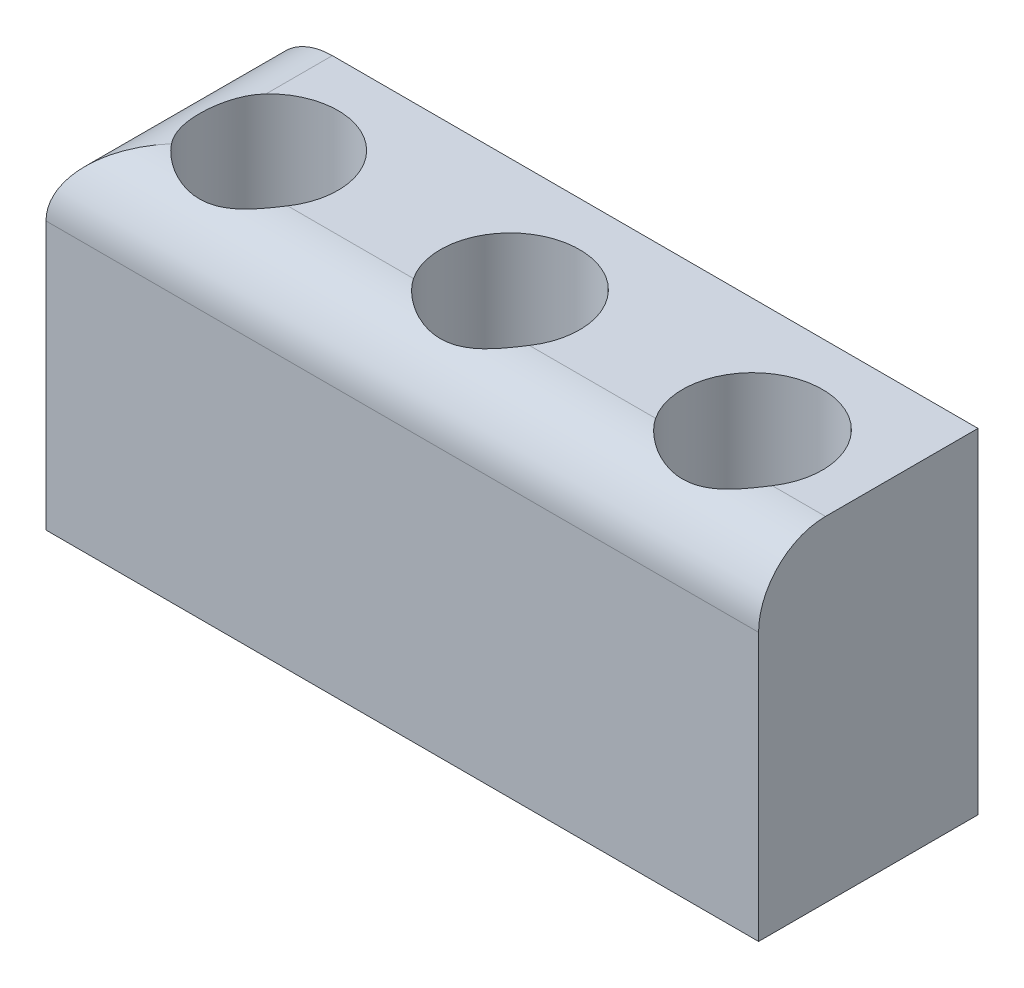
ISO-10303-21;
HEADER;
FILE_DESCRIPTION(('STEP AP214'),'2;1');
FILE_NAME('part.step','',(''),(''),'','','');
FILE_SCHEMA(('AUTOMOTIVE_DESIGN { 1 0 10303 214 1 1 1 1 }'));
ENDSEC;
DATA;
#1=APPLICATION_CONTEXT('core data for automotive mechanical design processes');
#2=APPLICATION_PROTOCOL_DEFINITION('international standard','automotive_design',2000,#1);
#3=PRODUCT_CONTEXT('',#1,'mechanical');
#4=PRODUCT('Part','Part','',(#3));
#5=PRODUCT_RELATED_PRODUCT_CATEGORY('part','',(#4));
#6=PRODUCT_DEFINITION_FORMATION('','',#4);
#7=PRODUCT_DEFINITION_CONTEXT('part definition',#1,'design');
#8=PRODUCT_DEFINITION('design','',#6,#7);
#9=PRODUCT_DEFINITION_SHAPE('','',#8);
#10=(LENGTH_UNIT() NAMED_UNIT(*) SI_UNIT(.MILLI.,.METRE.));
#11=(NAMED_UNIT(*) PLANE_ANGLE_UNIT() SI_UNIT($,.RADIAN.));
#12=(NAMED_UNIT(*) SI_UNIT($,.STERADIAN.) SOLID_ANGLE_UNIT());
#13=UNCERTAINTY_MEASURE_WITH_UNIT(LENGTH_MEASURE(1.E-05),#10,'distance_accuracy_value','');
#14=(GEOMETRIC_REPRESENTATION_CONTEXT(3) GLOBAL_UNCERTAINTY_ASSIGNED_CONTEXT((#13)) GLOBAL_UNIT_ASSIGNED_CONTEXT((#10,
#11,#12)) REPRESENTATION_CONTEXT('',''));
#15=CARTESIAN_POINT('',(0.,0.,0.));
#16=DIRECTION('',(0.,0.,1.));
#17=DIRECTION('',(1.,0.,0.));
#18=AXIS2_PLACEMENT_3D('',#15,#16,#17);
#19=CARTESIAN_POINT('',(0.,10.,0.));
#20=DIRECTION('',(0.,0.,-1.));
#21=DIRECTION('',(-1.,0.,0.));
#22=AXIS2_PLACEMENT_3D('',#19,#20,#21);
#23=PLANE('',#22);
#24=DIRECTION('',(0.,-1.,0.));
#25=VECTOR('',#24,1.);
#26=CARTESIAN_POINT('',(21.2931862765664,10.,0.));
#27=LINE('',#26,#25);
#28=CARTESIAN_POINT('',(21.2931862765664,8.,0.));
#29=VERTEX_POINT('',#28);
#30=CARTESIAN_POINT('',(21.2931862765664,0.,0.));
#31=VERTEX_POINT('',#30);
#32=EDGE_CURVE('E141',#29,#31,#27,.T.);
#33=ORIENTED_EDGE('',*,*,#32,.F.);
#34=DIRECTION('',(1.,0.,0.));
#35=VECTOR('',#34,1.);
#36=CARTESIAN_POINT('',(0.,8.,0.));
#37=LINE('',#36,#35);
#38=CARTESIAN_POINT('',(0.,8.,0.));
#39=VERTEX_POINT('',#38);
#40=EDGE_CURVE('E337',#29,#39,#37,.F.);
#41=ORIENTED_EDGE('',*,*,#40,.T.);
#42=DIRECTION('',(0.,-1.,0.));
#43=VECTOR('',#42,1.);
#44=CARTESIAN_POINT('',(0.,10.,0.));
#45=LINE('',#44,#43);
#46=CARTESIAN_POINT('',(0.,0.,0.));
#47=VERTEX_POINT('',#46);
#48=EDGE_CURVE('E122',#39,#47,#45,.T.);
#49=ORIENTED_EDGE('',*,*,#48,.T.);
#50=DIRECTION('',(1.,0.,0.));
#51=VECTOR('',#50,1.);
#52=CARTESIAN_POINT('',(0.,0.,0.));
#53=LINE('',#52,#51);
#54=EDGE_CURVE('E323',#47,#31,#53,.T.);
#55=ORIENTED_EDGE('',*,*,#54,.T.);
#56=EDGE_LOOP('',(#33,#41,#49,#55));
#57=FACE_BOUND('',#56,.T.);
#58=ADVANCED_FACE('F41',(#57),#23,.F.);
#59=CARTESIAN_POINT('',(21.2931862765664,10.,0.));
#60=DIRECTION('',(-1.,0.,0.));
#61=DIRECTION('',(0.,0.,1.));
#62=AXIS2_PLACEMENT_3D('',#59,#60,#61);
#63=PLANE('',#62);
#64=DIRECTION('',(0.,0.,-1.));
#65=VECTOR('',#64,1.);
#66=CARTESIAN_POINT('',(21.2931862765664,10.,0.));
#67=LINE('',#66,#65);
#68=CARTESIAN_POINT('',(21.2931862765664,10.,-2.));
#69=VERTEX_POINT('',#68);
#70=CARTESIAN_POINT('',(21.2931862765664,10.,-6.55624890817712));
#71=VERTEX_POINT('',#70);
#72=EDGE_CURVE('E123',#69,#71,#67,.T.);
#73=ORIENTED_EDGE('',*,*,#72,.F.);
#74=CARTESIAN_POINT('',(21.2931862765664,8.,-2.));
#75=DIRECTION('',(-1.,0.,0.));
#76=DIRECTION('',(0.,0.,1.));
#77=AXIS2_PLACEMENT_3D('',#74,#75,#76);
#78=CIRCLE('',#77,2.);
#79=EDGE_CURVE('E341',#69,#29,#78,.F.);
#80=ORIENTED_EDGE('',*,*,#79,.T.);
#81=ORIENTED_EDGE('',*,*,#32,.T.);
#82=DIRECTION('',(0.,0.,-1.));
#83=VECTOR('',#82,1.);
#84=CARTESIAN_POINT('',(21.2931862765664,0.,0.));
#85=LINE('',#84,#83);
#86=CARTESIAN_POINT('',(21.2931862765664,0.,-6.55624890817712));
#87=VERTEX_POINT('',#86);
#88=EDGE_CURVE('E138',#31,#87,#85,.T.);
#89=ORIENTED_EDGE('',*,*,#88,.T.);
#90=DIRECTION('',(0.,-1.,0.));
#91=VECTOR('',#90,1.);
#92=CARTESIAN_POINT('',(21.2931862765664,10.,-6.55624890817712));
#93=LINE('',#92,#91);
#94=EDGE_CURVE('E116',#71,#87,#93,.T.);
#95=ORIENTED_EDGE('',*,*,#94,.F.);
#96=EDGE_LOOP('',(#73,#80,#81,#89,#95));
#97=FACE_BOUND('',#96,.T.);
#98=ADVANCED_FACE('F136',(#97),#63,.F.);
#99=CARTESIAN_POINT('',(0.,10.,-6.55624890817712));
#100=DIRECTION('',(0.,0.,-1.));
#101=DIRECTION('',(-1.,0.,0.));
#102=AXIS2_PLACEMENT_3D('',#99,#100,#101);
#103=PLANE('',#102);
#104=DIRECTION('',(0.,-1.,0.));
#105=VECTOR('',#104,1.);
#106=CARTESIAN_POINT('',(0.,10.,-6.55624890817712));
#107=LINE('',#106,#105);
#108=CARTESIAN_POINT('',(0.,8.,-6.55624890817712));
#109=VERTEX_POINT('',#108);
#110=CARTESIAN_POINT('',(0.,0.,-6.55624890817712));
#111=VERTEX_POINT('',#110);
#112=EDGE_CURVE('E142',#109,#111,#107,.T.);
#113=ORIENTED_EDGE('',*,*,#112,.F.);
#114=CARTESIAN_POINT('',(2.,8.,-6.55624890817712));
#115=DIRECTION('',(0.,0.,-1.));
#116=DIRECTION('',(-1.,0.,0.));
#117=AXIS2_PLACEMENT_3D('',#114,#115,#116);
#118=CIRCLE('',#117,2.);
#119=CARTESIAN_POINT('',(2.,10.,-6.55624890817712));
#120=VERTEX_POINT('',#119);
#121=EDGE_CURVE('E11',#109,#120,#118,.T.);
#122=ORIENTED_EDGE('',*,*,#121,.T.);
#123=DIRECTION('',(1.,0.,0.));
#124=VECTOR('',#123,1.);
#125=CARTESIAN_POINT('',(0.,10.,-6.55624890817712));
#126=LINE('',#125,#124);
#127=EDGE_CURVE('E111',#120,#71,#126,.T.);
#128=ORIENTED_EDGE('',*,*,#127,.T.);
#129=ORIENTED_EDGE('',*,*,#94,.T.);
#130=DIRECTION('',(1.,0.,0.));
#131=VECTOR('',#130,1.);
#132=CARTESIAN_POINT('',(0.,0.,-6.55624890817712));
#133=LINE('',#132,#131);
#134=EDGE_CURVE('E329',#111,#87,#133,.T.);
#135=ORIENTED_EDGE('',*,*,#134,.F.);
#136=EDGE_LOOP('',(#113,#122,#128,#129,#135));
#137=FACE_BOUND('',#136,.T.);
#138=ADVANCED_FACE('F113',(#137),#103,.T.);
#139=CARTESIAN_POINT('',(10.7125456911819,10.,-3.15215181068118));
#140=DIRECTION('',(0.,-1.,0.));
#141=DIRECTION('',(0.,0.,-1.));
#142=AXIS2_PLACEMENT_3D('',#139,#140,#141);
#143=CYLINDRICAL_SURFACE('',#142,2.08);
#144=CARTESIAN_POINT('',(10.7125456911819,10.,-3.15215181068118));
#145=DIRECTION('',(0.,1.,0.));
#146=DIRECTION('',(0.,0.,1.));
#147=AXIS2_PLACEMENT_3D('',#144,#145,#146);
#148=CIRCLE('',#147,2.08);
#149=CARTESIAN_POINT('',(12.4442922676601,10.,-2.));
#150=VERTEX_POINT('',#149);
#151=CARTESIAN_POINT('',(8.98079911470363,10.,-2.));
#152=VERTEX_POINT('',#151);
#153=EDGE_CURVE('E134',#150,#152,#148,.T.);
#154=ORIENTED_EDGE('',*,*,#153,.T.);
#155=CARTESIAN_POINT('',(8.98079911470363,10.,-2.));
#156=CARTESIAN_POINT('',(9.01180896715374,10.0000019166528,-1.95338103054374));
#157=CARTESIAN_POINT('',(9.04467929727003,9.99837017862141,-1.90806709129068));
#158=CARTESIAN_POINT('',(9.11382249488943,9.99240214108706,-1.82038861836455));
#159=CARTESIAN_POINT('',(9.15009110295871,9.98806918977738,-1.77802050545357));
#160=CARTESIAN_POINT('',(9.26324458610879,9.97190997339697,-1.65610048268165));
#161=CARTESIAN_POINT('',(9.34480683664065,9.95691156190674,-1.58124043804073));
#162=CARTESIAN_POINT('',(9.51775955711176,9.92300619119465,-1.4460118153078));
#163=CARTESIAN_POINT('',(9.60910960513722,9.90411503081034,-1.38558672892647));
#164=CARTESIAN_POINT('',(9.8003283720189,9.86661850179612,-1.27965913078393));
#165=CARTESIAN_POINT('',(9.90021021524761,9.84801362738575,-1.23418015093139));
#166=CARTESIAN_POINT('',(10.115140293136,9.81386343226349,-1.15626295850057));
#167=CARTESIAN_POINT('',(10.2307608459067,9.79869266070333,-1.12519507994771));
#168=CARTESIAN_POINT('',(10.4073198790383,9.7829523507128,-1.09379768310674));
#169=CARTESIAN_POINT('',(10.4666796466666,9.77887502597061,-1.08586603507893));
#170=CARTESIAN_POINT('',(10.5859788825626,9.77332296594361,-1.07514254852599));
#171=CARTESIAN_POINT('',(10.6459182749269,9.77184789440609,-1.07235004593911));
#172=CARTESIAN_POINT('',(10.8143484948677,9.77158835963892,-1.07182320845275));
#173=CARTESIAN_POINT('',(10.9229314559172,9.77594147039952,-1.08000001855579));
#174=CARTESIAN_POINT('',(11.1368639585769,9.79264091612337,-1.11300808452386));
#175=CARTESIAN_POINT('',(11.2422112780962,9.80499262103718,-1.13785052946263));
#176=CARTESIAN_POINT('',(11.4455772305949,9.83455223787364,-1.20271769407757));
#177=CARTESIAN_POINT('',(11.5436816916135,9.85168502670209,-1.24251061124707));
#178=CARTESIAN_POINT('',(11.7326093243011,9.88736086484379,-1.33638565981454));
#179=CARTESIAN_POINT('',(11.8234262368483,9.90590510034153,-1.39047990666235));
#180=CARTESIAN_POINT('',(11.9969207029794,9.9407502466485,-1.51259571857778));
#181=CARTESIAN_POINT('',(12.0795173167456,9.95702937860135,-1.58073868425591));
#182=CARTESIAN_POINT('',(12.2336275033505,9.98304107428705,-1.72944607301804));
#183=CARTESIAN_POINT('',(12.3051764891037,9.99279490456057,-1.80996908268802));
#184=CARTESIAN_POINT('',(12.3829965385072,9.99816311696467,-1.91261406853426));
#185=CARTESIAN_POINT('',(12.3956304918317,9.99884456169817,-1.92982469870153));
#186=CARTESIAN_POINT('',(12.4203632483832,9.99976266836173,-1.96462805566558));
#187=CARTESIAN_POINT('',(12.4324622506076,9.99999949706791,-1.98222063668618));
#188=CARTESIAN_POINT('',(12.4442922676601,10.,-2.));
#189=B_SPLINE_CURVE_WITH_KNOTS('',3,(#155,#156,#157,#158,#159,#160,#161,#162,#163,#164,#165,
#166,#167,#168,#169,#170,#171,#172,#173,#174,#175,#176,#177,#178,#179,#180,#181,#182,#183,#184,
#185,#186,#187,#188),.UNSPECIFIED.,.F.,.F.,(4,2,2,2,2,2,2,2,2,2,2,2,2,2,2,2,4),(0.,
0.167808567179974,0.33540954562784,0.668859517194502,1.00098192435599,1.33362476427687,
1.6934662317237,1.87330072827306,2.05311198562873,2.37822992216897,2.70356635708084,
3.02405382143709,3.34481366336347,3.66847115111884,3.99106860362878,4.0551424901214,
4.11919233760168),.UNSPECIFIED.);
#190=EDGE_CURVE('E162',#152,#150,#189,.T.);
#191=ORIENTED_EDGE('',*,*,#190,.T.);
#192=EDGE_LOOP('',(#154,#191));
#193=FACE_BOUND('',#192,.T.);
#194=CARTESIAN_POINT('',(10.7125456911819,0.,-3.15215181068118));
#195=DIRECTION('',(0.,1.,0.));
#196=DIRECTION('',(0.,0.,1.));
#197=AXIS2_PLACEMENT_3D('',#194,#195,#196);
#198=CIRCLE('',#197,2.08);
#199=CARTESIAN_POINT('',(10.7125456911819,0.,-1.07215181068118));
#200=VERTEX_POINT('',#199);
#201=EDGE_CURVE('E319',#200,#200,#198,.T.);
#202=ORIENTED_EDGE('',*,*,#201,.F.);
#203=EDGE_LOOP('',(#202));
#204=FACE_BOUND('',#203,.T.);
#205=ADVANCED_FACE('F177',(#193,#204),#143,.F.);
#206=CARTESIAN_POINT('',(3.50247739127908,10.,-3.15215181068118));
#207=DIRECTION('',(0.,-1.,0.));
#208=DIRECTION('',(0.,0.,-1.));
#209=AXIS2_PLACEMENT_3D('',#206,#207,#208);
#210=CYLINDRICAL_SURFACE('',#209,2.07);
#211=CARTESIAN_POINT('',(2.,10.,-4.57604144428879));
#212=CARTESIAN_POINT('',(1.96036679714811,9.99999707882455,-4.53422316293406));
#213=CARTESIAN_POINT('',(1.92251587021773,9.99882261789642,-4.49078245878152));
#214=CARTESIAN_POINT('',(1.85061662715664,9.99473859199886,-4.40097642169513));
#215=CARTESIAN_POINT('',(1.81656601006317,9.99183008377862,-4.35461288534611));
#216=CARTESIAN_POINT('',(1.72045112077785,9.98141696742201,-4.21161130740531));
#217=CARTESIAN_POINT('',(1.66436244935136,9.97222290315426,-4.11099733985641));
#218=CARTESIAN_POINT('',(1.56967921530682,9.95375567599168,-3.90205267409746));
#219=CARTESIAN_POINT('',(1.53106668848009,9.94448260434939,-3.79373003304136));
#220=CARTESIAN_POINT('',(1.47227150718663,9.9293611235774,-3.57201823316238));
#221=CARTESIAN_POINT('',(1.4520722660175,9.92350963399121,-3.45863373085755));
#222=CARTESIAN_POINT('',(1.4307128104904,9.91730159347554,-3.22948897901125));
#223=CARTESIAN_POINT('',(1.42962449841147,9.91696579489131,-3.11372139726664));
#224=CARTESIAN_POINT('',(1.44672345146167,9.92196713741477,-2.88365286995667));
#225=CARTESIAN_POINT('',(1.46492711904998,9.92730910589429,-2.76935325617845));
#226=CARTESIAN_POINT('',(1.51926160419367,9.94155748481635,-2.54851847207674));
#227=CARTESIAN_POINT('',(1.55492110976482,9.95036905366634,-2.44185939413661));
#228=CARTESIAN_POINT('',(1.64296108715625,9.96838165030904,-2.2358531776544));
#229=CARTESIAN_POINT('',(1.69531160720114,9.97758195506095,-2.13649333074763));
#230=CARTESIAN_POINT('',(1.77372614595959,9.98724459864288,-2.01307291818252));
#231=CARTESIAN_POINT('',(1.79283975780935,9.98934168283344,-1.98458204824374));
#232=CARTESIAN_POINT('',(1.83244913092659,9.99306859050462,-1.92860082018352));
#233=CARTESIAN_POINT('',(1.85294311237602,9.99469900197677,-1.90110924147882));
#234=CARTESIAN_POINT('',(1.87412225414689,9.99603476750755,-1.87412225414689));
#235=B_SPLINE_CURVE_WITH_KNOTS('',3,(#211,#212,#213,#214,#215,#216,#217,#218,#219,#220,#221,
#222,#223,#224,#225,#226,#227,#228,#229,#230,#231,#232,#233,#234),.UNSPECIFIED.,.F.,.F.,(4,2,2,
2,2,2,2,2,2,2,2,4),(0.,0.17270140314731,0.345297667415201,0.690225662025595,1.03479828590721,
1.379060210889,1.72461709832327,2.0704680215931,2.40745696425314,2.74384455703446,
2.84692906580633,2.9498831140911),.UNSPECIFIED.);
#236=CARTESIAN_POINT('',(2.,10.,-4.57604144428879));
#237=VERTEX_POINT('',#236);
#238=CARTESIAN_POINT('',(1.87412225414689,9.99603476750755,-1.87412225414689));
#239=VERTEX_POINT('',#238);
#240=EDGE_CURVE('E66',#237,#239,#235,.T.);
#241=ORIENTED_EDGE('',*,*,#240,.T.);
#242=CARTESIAN_POINT('',(1.87412225414689,9.99603476750755,-1.87412225414689));
#243=CARTESIAN_POINT('',(1.94507286388203,9.990319517779,-1.78365756447952));
#244=CARTESIAN_POINT('',(2.02318854937418,9.9788690208992,-1.69969420692727));
#245=CARTESIAN_POINT('',(2.19138674646631,9.94941867234756,-1.54627939916142));
#246=CARTESIAN_POINT('',(2.28145387450414,9.93142718910737,-1.47680958408447));
#247=CARTESIAN_POINT('',(2.471120016652,9.89382878924803,-1.3538244796847));
#248=CARTESIAN_POINT('',(2.5706918322233,9.87422650323236,-1.30026536774207));
#249=CARTESIAN_POINT('',(2.77778845376593,9.83795768172353,-1.20987270045166));
#250=CARTESIAN_POINT('',(2.88531301351563,9.82129105539462,-1.17303862753873));
#251=CARTESIAN_POINT('',(3.05227015663797,9.80133874380286,-1.13085014442994));
#252=CARTESIAN_POINT('',(3.10979401599607,9.79548079123884,-1.11888795397806));
#253=CARTESIAN_POINT('',(3.22582262587424,9.78602992905087,-1.09988186401231));
#254=CARTESIAN_POINT('',(3.28432690234669,9.78243595544834,-1.09283565401869));
#255=CARTESIAN_POINT('',(3.40178436230516,9.77779040247215,-1.08376414879636));
#256=CARTESIAN_POINT('',(3.46073719522642,9.77673700861331,-1.08173527015714));
#257=CARTESIAN_POINT('',(3.57857215981747,9.77723852888688,-1.08271089441086));
#258=CARTESIAN_POINT('',(3.63745429684939,9.77879323081001,-1.08571498779298));
#259=CARTESIAN_POINT('',(3.80062544083609,9.78662867022699,-1.10105171060453));
#260=CARTESIAN_POINT('',(3.90432285187838,9.79565893095703,-1.11885126321481));
#261=CARTESIAN_POINT('',(4.10720065971113,9.81970801836295,-1.16968101434919));
#262=CARTESIAN_POINT('',(4.20637549918926,9.83473400275226,-1.20272942440583));
#263=CARTESIAN_POINT('',(4.4029085038148,9.86840441335405,-1.28506359483207));
#264=CARTESIAN_POINT('',(4.49994385561551,9.88718925702669,-1.33506074507491));
#265=CARTESIAN_POINT('',(4.68498068935694,9.92373475876342,-1.44967871941794));
#266=CARTESIAN_POINT('',(4.77299533918798,9.94149689261751,-1.51427777355629));
#267=CARTESIAN_POINT('',(4.92513523114569,9.9693240153861,-1.64571155583157));
#268=CARTESIAN_POINT('',(4.99083234498389,9.9801645208527,-1.71054970157138));
#269=CARTESIAN_POINT('',(5.08275905434569,9.99166910590021,-1.81433324320037));
#270=CARTESIAN_POINT('',(5.11234315100588,9.99471238461133,-1.85008242059616));
#271=CARTESIAN_POINT('',(5.16911707885598,9.99887926197681,-1.92358648607553));
#272=CARTESIAN_POINT('',(5.19630482857778,10.0000012070466,-1.96134307304321));
#273=CARTESIAN_POINT('',(5.22220010298119,10.,-2.));
#274=B_SPLINE_CURVE_WITH_KNOTS('',3,(#242,#243,#244,#245,#246,#247,#248,#249,#250,#251,#252,
#253,#254,#255,#256,#257,#258,#259,#260,#261,#262,#263,#264,#265,#266,#267,#268,#269,#270,#271,
#272,#273),.UNSPECIFIED.,.F.,.F.,(4,2,2,2,2,2,2,2,2,2,2,2,2,2,2,4),(0.,0.344241691174559,
0.688044506108547,1.03089141828971,1.37372772016919,1.55064982293769,1.72748871731794,
1.90420127569294,2.08089945644212,2.39612269559112,2.71172338050438,3.04266985950114,
3.37312614763692,3.65092420787513,3.79030211783007,3.92979992239504),.UNSPECIFIED.);
#275=CARTESIAN_POINT('',(5.22220010298119,10.,-2.));
#276=VERTEX_POINT('',#275);
#277=EDGE_CURVE('E190',#239,#276,#274,.T.);
#278=ORIENTED_EDGE('',*,*,#277,.T.);
#279=CARTESIAN_POINT('',(3.50247739127908,10.,-3.15215181068118));
#280=DIRECTION('',(0.,1.,0.));
#281=DIRECTION('',(0.,0.,1.));
#282=AXIS2_PLACEMENT_3D('',#279,#280,#281);
#283=CIRCLE('',#282,2.07);
#284=EDGE_CURVE('E297',#276,#237,#283,.T.);
#285=ORIENTED_EDGE('',*,*,#284,.T.);
#286=EDGE_LOOP('',(#241,#278,#285));
#287=FACE_BOUND('',#286,.T.);
#288=CARTESIAN_POINT('',(3.50247739127908,0.,-3.15215181068118));
#289=DIRECTION('',(0.,1.,0.));
#290=DIRECTION('',(0.,0.,1.));
#291=AXIS2_PLACEMENT_3D('',#288,#289,#290);
#292=CIRCLE('',#291,2.07);
#293=CARTESIAN_POINT('',(3.50247739127908,0.,-1.08215181068118));
#294=VERTEX_POINT('',#293);
#295=EDGE_CURVE('E315',#294,#294,#292,.T.);
#296=ORIENTED_EDGE('',*,*,#295,.F.);
#297=EDGE_LOOP('',(#296));
#298=FACE_BOUND('',#297,.T.);
#299=ADVANCED_FACE('F203',(#287,#298),#210,.F.);
#300=CARTESIAN_POINT('',(17.959518774191,10.,-3.15215181068118));
#301=DIRECTION('',(0.,-1.,0.));
#302=DIRECTION('',(0.,0.,-1.));
#303=AXIS2_PLACEMENT_3D('',#300,#301,#302);
#304=CYLINDRICAL_SURFACE('',#303,2.09);
#305=CARTESIAN_POINT('',(17.959518774191,10.,-3.15215181068118));
#306=DIRECTION('',(0.,1.,0.));
#307=DIRECTION('',(0.,0.,1.));
#308=AXIS2_PLACEMENT_3D('',#305,#306,#307);
#309=CIRCLE('',#308,2.09);
#310=CARTESIAN_POINT('',(19.7032636537947,10.,-2.));
#311=VERTEX_POINT('',#310);
#312=CARTESIAN_POINT('',(16.2157738945874,10.,-2.));
#313=VERTEX_POINT('',#312);
#314=EDGE_CURVE('E301',#311,#313,#309,.T.);
#315=ORIENTED_EDGE('',*,*,#314,.T.);
#316=CARTESIAN_POINT('',(16.2157738945874,10.,-2.));
#317=CARTESIAN_POINT('',(16.2467295704129,10.0000019741106,-1.95313985606773));
#318=CARTESIAN_POINT('',(16.279552289612,9.99835327209272,-1.90758088545158));
#319=CARTESIAN_POINT('',(16.3486120516914,9.99231893908771,-1.81940755327972));
#320=CARTESIAN_POINT('',(16.3848447690364,9.98793673681227,-1.77678957701161));
#321=CARTESIAN_POINT('',(16.4978965614307,9.97158596307411,-1.65412891720234));
#322=CARTESIAN_POINT('',(16.5794077707726,9.95640106789979,-1.57877048546052));
#323=CARTESIAN_POINT('',(16.7522911733626,9.92202082117489,-1.4425346689784));
#324=CARTESIAN_POINT('',(16.84362208311,9.90284196478621,-1.38159985950296));
#325=CARTESIAN_POINT('',(17.0348581636715,9.86468387305603,-1.27461851795193));
#326=CARTESIAN_POINT('',(17.1347772193522,9.84570501885834,-1.22859669186551));
#327=CARTESIAN_POINT('',(17.3501791029127,9.81067595292403,-1.14939942923633));
#328=CARTESIAN_POINT('',(17.4662632709869,9.795010325933,-1.11764349887471));
#329=CARTESIAN_POINT('',(17.6436279171608,9.77860309517865,-1.08528570219803));
#330=CARTESIAN_POINT('',(17.7032728016109,9.77431608599766,-1.07704594967914));
#331=CARTESIAN_POINT('',(17.8231772465777,9.76838564706258,-1.06573450646378));
#332=CARTESIAN_POINT('',(17.8834367235968,9.76674186289441,-1.06266212290346));
#333=CARTESIAN_POINT('',(18.0526954232347,9.76608702553137,-1.06139696148632));
#334=CARTESIAN_POINT('',(18.1618211739339,9.77026701318079,-1.06913530719302));
#335=CARTESIAN_POINT('',(18.3768936859951,9.78682446060064,-1.1013565044714));
#336=CARTESIAN_POINT('',(18.4828382311408,9.79920750267432,-1.12585075906473));
#337=CARTESIAN_POINT('',(18.6870624337084,9.82896654119358,-1.19000140325922));
#338=CARTESIAN_POINT('',(18.7854466531901,9.84624734347235,-1.22937307787282));
#339=CARTESIAN_POINT('',(18.9749993400326,9.88237020236857,-1.32238274915134));
#340=CARTESIAN_POINT('',(19.0661616181094,9.90121357041538,-1.37603281453285));
#341=CARTESIAN_POINT('',(19.2408298075001,9.93689906685412,-1.49751600015685));
#342=CARTESIAN_POINT('',(19.3242159293335,9.95371079040045,-1.56553058001014));
#343=CARTESIAN_POINT('',(19.4799313677929,9.98089123546876,-1.71411733264109));
#344=CARTESIAN_POINT('',(19.55229523521,9.99128041622523,-1.79464859639096));
#345=CARTESIAN_POINT('',(19.6329402060382,9.99758416945758,-1.89980808699465));
#346=CARTESIAN_POINT('',(19.6474939112682,9.99847898283674,-1.91949534626032));
#347=CARTESIAN_POINT('',(19.6759038748367,9.99968651760369,-1.95937401016248));
#348=CARTESIAN_POINT('',(19.6897603670009,9.99999943542601,-1.97956524233586));
#349=CARTESIAN_POINT('',(19.7032636537947,10.,-2.));
#350=B_SPLINE_CURVE_WITH_KNOTS('',3,(#316,#317,#318,#319,#320,#321,#322,#323,#324,#325,#326,
#327,#328,#329,#330,#331,#332,#333,#334,#335,#336,#337,#338,#339,#340,#341,#342,#343,#344,#345,
#346,#347,#348,#349),.UNSPECIFIED.,.F.,.F.,(4,2,2,2,2,2,2,2,2,2,2,2,2,2,2,2,4),(0.,
0.168320843463202,0.336430980406311,0.670844173028901,1.00390268937026,1.3375101880106,
1.69939447715465,1.88023984255198,2.06106095746308,2.38766490635012,2.71449134282624,
3.03535629278303,3.35649331786445,3.68195979464509,4.00638407077827,4.07986649842747,
4.15332411559694),.UNSPECIFIED.);
#351=EDGE_CURVE('E170',#313,#311,#350,.T.);
#352=ORIENTED_EDGE('',*,*,#351,.T.);
#353=EDGE_LOOP('',(#315,#352));
#354=FACE_BOUND('',#353,.T.);
#355=CARTESIAN_POINT('',(17.959518774191,0.,-3.15215181068118));
#356=DIRECTION('',(0.,1.,0.));
#357=DIRECTION('',(0.,0.,1.));
#358=AXIS2_PLACEMENT_3D('',#355,#356,#357);
#359=CIRCLE('',#358,2.09);
#360=CARTESIAN_POINT('',(17.959518774191,0.,-1.06215181068118));
#361=VERTEX_POINT('',#360);
#362=EDGE_CURVE('E311',#361,#361,#359,.T.);
#363=ORIENTED_EDGE('',*,*,#362,.F.);
#364=EDGE_LOOP('',(#363));
#365=FACE_BOUND('',#364,.T.);
#366=ADVANCED_FACE('F185',(#354,#365),#304,.F.);
#367=CARTESIAN_POINT('',(0.,10.,0.));
#368=DIRECTION('',(-1.,0.,0.));
#369=DIRECTION('',(0.,0.,1.));
#370=AXIS2_PLACEMENT_3D('',#367,#368,#369);
#371=PLANE('',#370);
#372=ORIENTED_EDGE('',*,*,#48,.F.);
#373=DIRECTION('',(0.,0.,-1.));
#374=VECTOR('',#373,1.);
#375=CARTESIAN_POINT('',(0.,8.,0.));
#376=LINE('',#375,#374);
#377=EDGE_CURVE('E52',#39,#109,#376,.T.);
#378=ORIENTED_EDGE('',*,*,#377,.T.);
#379=ORIENTED_EDGE('',*,*,#112,.T.);
#380=DIRECTION('',(0.,0.,-1.));
#381=VECTOR('',#380,1.);
#382=CARTESIAN_POINT('',(0.,0.,0.));
#383=LINE('',#382,#381);
#384=EDGE_CURVE('E308',#47,#111,#383,.T.);
#385=ORIENTED_EDGE('',*,*,#384,.F.);
#386=EDGE_LOOP('',(#372,#378,#379,#385));
#387=FACE_BOUND('',#386,.T.);
#388=ADVANCED_FACE('F211',(#387),#371,.T.);
#389=CARTESIAN_POINT('',(0.,10.,0.));
#390=DIRECTION('',(0.,1.,0.));
#391=DIRECTION('',(0.,0.,1.));
#392=AXIS2_PLACEMENT_3D('',#389,#390,#391);
#393=PLANE('',#392);
#394=ORIENTED_EDGE('',*,*,#284,.F.);
#395=DIRECTION('',(1.,0.,0.));
#396=VECTOR('',#395,1.);
#397=CARTESIAN_POINT('',(21.2931862765664,10.,-2.));
#398=LINE('',#397,#396);
#399=EDGE_CURVE('E158',#276,#152,#398,.T.);
#400=ORIENTED_EDGE('',*,*,#399,.T.);
#401=ORIENTED_EDGE('',*,*,#153,.F.);
#402=DIRECTION('',(1.,0.,0.));
#403=VECTOR('',#402,1.);
#404=CARTESIAN_POINT('',(21.2931862765664,10.,-2.));
#405=LINE('',#404,#403);
#406=EDGE_CURVE('E155',#150,#313,#405,.T.);
#407=ORIENTED_EDGE('',*,*,#406,.T.);
#408=ORIENTED_EDGE('',*,*,#314,.F.);
#409=DIRECTION('',(1.,0.,0.));
#410=VECTOR('',#409,1.);
#411=CARTESIAN_POINT('',(21.2931862765664,10.,-2.));
#412=LINE('',#411,#410);
#413=EDGE_CURVE('E130',#311,#69,#412,.T.);
#414=ORIENTED_EDGE('',*,*,#413,.T.);
#415=ORIENTED_EDGE('',*,*,#72,.T.);
#416=ORIENTED_EDGE('',*,*,#127,.F.);
#417=DIRECTION('',(0.,0.,-1.));
#418=VECTOR('',#417,1.);
#419=CARTESIAN_POINT('',(2.,10.,0.));
#420=LINE('',#419,#418);
#421=EDGE_CURVE('E146',#120,#237,#420,.F.);
#422=ORIENTED_EDGE('',*,*,#421,.T.);
#423=EDGE_LOOP('',(#394,#400,#401,#407,#408,#414,#415,#416,#422));
#424=FACE_BOUND('',#423,.T.);
#425=ADVANCED_FACE('F127',(#424),#393,.T.);
#426=CARTESIAN_POINT('',(0.,0.,0.));
#427=DIRECTION('',(0.,1.,0.));
#428=DIRECTION('',(0.,0.,1.));
#429=AXIS2_PLACEMENT_3D('',#426,#427,#428);
#430=PLANE('',#429);
#431=ORIENTED_EDGE('',*,*,#362,.T.);
#432=EDGE_LOOP('',(#431));
#433=FACE_BOUND('',#432,.T.);
#434=ORIENTED_EDGE('',*,*,#295,.T.);
#435=EDGE_LOOP('',(#434));
#436=FACE_BOUND('',#435,.T.);
#437=ORIENTED_EDGE('',*,*,#201,.T.);
#438=EDGE_LOOP('',(#437));
#439=FACE_BOUND('',#438,.T.);
#440=ORIENTED_EDGE('',*,*,#54,.F.);
#441=ORIENTED_EDGE('',*,*,#384,.T.);
#442=ORIENTED_EDGE('',*,*,#134,.T.);
#443=ORIENTED_EDGE('',*,*,#88,.F.);
#444=EDGE_LOOP('',(#440,#441,#442,#443));
#445=FACE_BOUND('',#444,.T.);
#446=ADVANCED_FACE('F227',(#433,#436,#439,#445),#430,.F.);
#447=CARTESIAN_POINT('',(2.,8.,0.));
#448=DIRECTION('',(0.,0.,-1.));
#449=DIRECTION('',(-1.,0.,0.));
#450=AXIS2_PLACEMENT_3D('',#447,#448,#449);
#451=CYLINDRICAL_SURFACE('',#450,2.);
#452=ORIENTED_EDGE('',*,*,#121,.F.);
#453=ORIENTED_EDGE('',*,*,#377,.F.);
#454=CARTESIAN_POINT('',(2.,8.,-2.));
#455=DIRECTION('',(-0.707106781186547,0.,-0.707106781186547));
#456=DIRECTION('',(0.707106781186547,0.,-0.707106781186547));
#457=AXIS2_PLACEMENT_3D('',#454,#455,#456);
#458=ELLIPSE('',#457,2.82842712474619,2.);
#459=EDGE_CURVE('E46',#239,#39,#458,.F.);
#460=ORIENTED_EDGE('',*,*,#459,.F.);
#461=ORIENTED_EDGE('',*,*,#240,.F.);
#462=ORIENTED_EDGE('',*,*,#421,.F.);
#463=EDGE_LOOP('',(#452,#453,#460,#461,#462));
#464=FACE_BOUND('',#463,.T.);
#465=ADVANCED_FACE('F43',(#464),#451,.T.);
#466=CARTESIAN_POINT('',(0.,8.,-2.));
#467=DIRECTION('',(-1.,0.,0.));
#468=DIRECTION('',(0.,0.,1.));
#469=AXIS2_PLACEMENT_3D('',#466,#467,#468);
#470=CYLINDRICAL_SURFACE('',#469,2.);
#471=ORIENTED_EDGE('',*,*,#459,.T.);
#472=ORIENTED_EDGE('',*,*,#40,.F.);
#473=ORIENTED_EDGE('',*,*,#79,.F.);
#474=ORIENTED_EDGE('',*,*,#413,.F.);
#475=ORIENTED_EDGE('',*,*,#351,.F.);
#476=ORIENTED_EDGE('',*,*,#406,.F.);
#477=ORIENTED_EDGE('',*,*,#190,.F.);
#478=ORIENTED_EDGE('',*,*,#399,.F.);
#479=ORIENTED_EDGE('',*,*,#277,.F.);
#480=EDGE_LOOP('',(#471,#472,#473,#474,#475,#476,#477,#478,#479));
#481=FACE_BOUND('',#480,.T.);
#482=ADVANCED_FACE('F181',(#481),#470,.T.);
#483=CLOSED_SHELL('',(#58,#98,#138,#205,#299,#366,#388,#425,#446,#465,#482));
#484=MANIFOLD_SOLID_BREP('B2',#483);
#485=ADVANCED_BREP_SHAPE_REPRESENTATION('',(#18,#484),#14);
#486=SHAPE_DEFINITION_REPRESENTATION(#9,#485);
ENDSEC;
END-ISO-10303-21;
